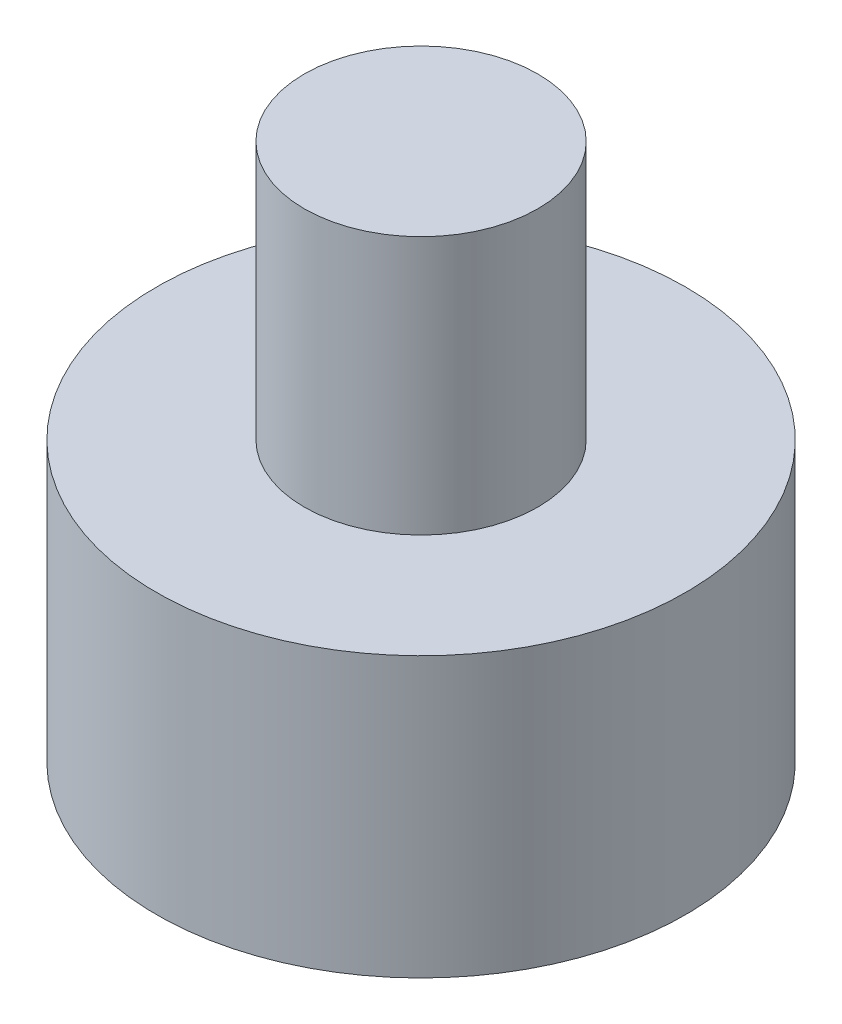
ISO-10303-21;
HEADER;
FILE_DESCRIPTION(('STEP AP214'),'2;1');
FILE_NAME('part.step','',(''),(''),'','','');
FILE_SCHEMA(('AUTOMOTIVE_DESIGN { 1 0 10303 214 1 1 1 1 }'));
ENDSEC;
DATA;
#1=APPLICATION_CONTEXT('core data for automotive mechanical design processes');
#2=APPLICATION_PROTOCOL_DEFINITION('international standard','automotive_design',2000,#1);
#3=PRODUCT_CONTEXT('',#1,'mechanical');
#4=PRODUCT('Part','Part','',(#3));
#5=PRODUCT_RELATED_PRODUCT_CATEGORY('part','',(#4));
#6=PRODUCT_DEFINITION_FORMATION('','',#4);
#7=PRODUCT_DEFINITION_CONTEXT('part definition',#1,'design');
#8=PRODUCT_DEFINITION('design','',#6,#7);
#9=PRODUCT_DEFINITION_SHAPE('','',#8);
#10=(LENGTH_UNIT() NAMED_UNIT(*) SI_UNIT(.MILLI.,.METRE.));
#11=(NAMED_UNIT(*) PLANE_ANGLE_UNIT() SI_UNIT($,.RADIAN.));
#12=(NAMED_UNIT(*) SI_UNIT($,.STERADIAN.) SOLID_ANGLE_UNIT());
#13=UNCERTAINTY_MEASURE_WITH_UNIT(LENGTH_MEASURE(1.E-05),#10,'distance_accuracy_value','');
#14=(GEOMETRIC_REPRESENTATION_CONTEXT(3) GLOBAL_UNCERTAINTY_ASSIGNED_CONTEXT((#13)) GLOBAL_UNIT_ASSIGNED_CONTEXT((#10,
#11,#12)) REPRESENTATION_CONTEXT('',''));
#15=CARTESIAN_POINT('',(0.,0.,0.));
#16=DIRECTION('',(0.,0.,1.));
#17=DIRECTION('',(1.,0.,0.));
#18=AXIS2_PLACEMENT_3D('',#15,#16,#17);
#19=CARTESIAN_POINT('',(50.2004532383012,17.8795568243255,0.));
#20=DIRECTION('',(0.,-1.,0.));
#21=DIRECTION('',(0.,0.,-1.));
#22=AXIS2_PLACEMENT_3D('',#19,#20,#21);
#23=PLANE('',#22);
#24=CARTESIAN_POINT('',(0.,17.8795568243255,0.));
#25=DIRECTION('',(0.,-1.,0.));
#26=DIRECTION('',(0.,0.,-1.));
#27=AXIS2_PLACEMENT_3D('',#24,#25,#26);
#28=CIRCLE('',#27,50.2004532383012);
#29=CARTESIAN_POINT('',(0.,17.8795568243255,-50.2004532383012));
#30=VERTEX_POINT('',#29);
#31=EDGE_CURVE('E54',#30,#30,#28,.T.);
#32=ORIENTED_EDGE('',*,*,#31,.T.);
#33=EDGE_LOOP('',(#32));
#34=FACE_BOUND('',#33,.T.);
#35=ADVANCED_FACE('F37',(#34),#23,.T.);
#36=CARTESIAN_POINT('',(0.,119.849227464625,0.));
#37=DIRECTION('',(0.,1.,0.));
#38=DIRECTION('',(0.,0.,1.));
#39=AXIS2_PLACEMENT_3D('',#36,#37,#38);
#40=PLANE('',#39);
#41=CARTESIAN_POINT('',(0.,119.849227464625,0.));
#42=DIRECTION('',(0.,-1.,0.));
#43=DIRECTION('',(0.,0.,-1.));
#44=AXIS2_PLACEMENT_3D('',#41,#42,#43);
#45=CIRCLE('',#44,22.1587938122189);
#46=CARTESIAN_POINT('',(0.,119.849227464625,-22.1587938122189));
#47=VERTEX_POINT('',#46);
#48=EDGE_CURVE('E10',#47,#47,#45,.T.);
#49=ORIENTED_EDGE('',*,*,#48,.F.);
#50=EDGE_LOOP('',(#49));
#51=FACE_BOUND('',#50,.T.);
#52=ADVANCED_FACE('F73',(#51),#40,.T.);
#53=CARTESIAN_POINT('',(0.,17.8795568243254,0.));
#54=DIRECTION('',(0.,-1.,0.));
#55=DIRECTION('',(0.,0.,-1.));
#56=AXIS2_PLACEMENT_3D('',#53,#54,#55);
#57=CYLINDRICAL_SURFACE('',#56,22.1587938122189);
#58=ORIENTED_EDGE('',*,*,#48,.T.);
#59=EDGE_LOOP('',(#58));
#60=FACE_BOUND('',#59,.T.);
#61=CARTESIAN_POINT('',(0.,70.8253473490963,0.));
#62=DIRECTION('',(0.,-1.,0.));
#63=DIRECTION('',(0.,0.,-1.));
#64=AXIS2_PLACEMENT_3D('',#61,#62,#63);
#65=CIRCLE('',#64,22.1587938122189);
#66=CARTESIAN_POINT('',(0.,70.8253473490963,-22.1587938122189));
#67=VERTEX_POINT('',#66);
#68=EDGE_CURVE('E44',#67,#67,#65,.T.);
#69=ORIENTED_EDGE('',*,*,#68,.F.);
#70=EDGE_LOOP('',(#69));
#71=FACE_BOUND('',#70,.T.);
#72=ADVANCED_FACE('F70',(#60,#71),#57,.T.);
#73=CARTESIAN_POINT('',(22.1587938122189,70.8253473490963,0.));
#74=DIRECTION('',(0.,1.,0.));
#75=DIRECTION('',(0.,0.,1.));
#76=AXIS2_PLACEMENT_3D('',#73,#74,#75);
#77=PLANE('',#76);
#78=ORIENTED_EDGE('',*,*,#68,.T.);
#79=EDGE_LOOP('',(#78));
#80=FACE_BOUND('',#79,.T.);
#81=CARTESIAN_POINT('',(0.,70.8253473490963,0.));
#82=DIRECTION('',(0.,-1.,0.));
#83=DIRECTION('',(0.,0.,-1.));
#84=AXIS2_PLACEMENT_3D('',#81,#82,#83);
#85=CIRCLE('',#84,50.2004532383012);
#86=CARTESIAN_POINT('',(0.,70.8253473490963,-50.2004532383012));
#87=VERTEX_POINT('',#86);
#88=EDGE_CURVE('E49',#87,#87,#85,.T.);
#89=ORIENTED_EDGE('',*,*,#88,.F.);
#90=EDGE_LOOP('',(#89));
#91=FACE_BOUND('',#90,.T.);
#92=ADVANCED_FACE('F64',(#80,#91),#77,.T.);
#93=CARTESIAN_POINT('',(0.,17.8795568243254,0.));
#94=DIRECTION('',(0.,-1.,0.));
#95=DIRECTION('',(0.,0.,-1.));
#96=AXIS2_PLACEMENT_3D('',#93,#94,#95);
#97=CYLINDRICAL_SURFACE('',#96,50.2004532383012);
#98=ORIENTED_EDGE('',*,*,#88,.T.);
#99=EDGE_LOOP('',(#98));
#100=FACE_BOUND('',#99,.T.);
#101=ORIENTED_EDGE('',*,*,#31,.F.);
#102=EDGE_LOOP('',(#101));
#103=FACE_BOUND('',#102,.T.);
#104=ADVANCED_FACE('F62',(#100,#103),#97,.T.);
#105=CLOSED_SHELL('',(#35,#52,#72,#92,#104));
#106=MANIFOLD_SOLID_BREP('B2',#105);
#107=ADVANCED_BREP_SHAPE_REPRESENTATION('',(#18,#106),#14);
#108=SHAPE_DEFINITION_REPRESENTATION(#9,#107);
ENDSEC;
END-ISO-10303-21;
